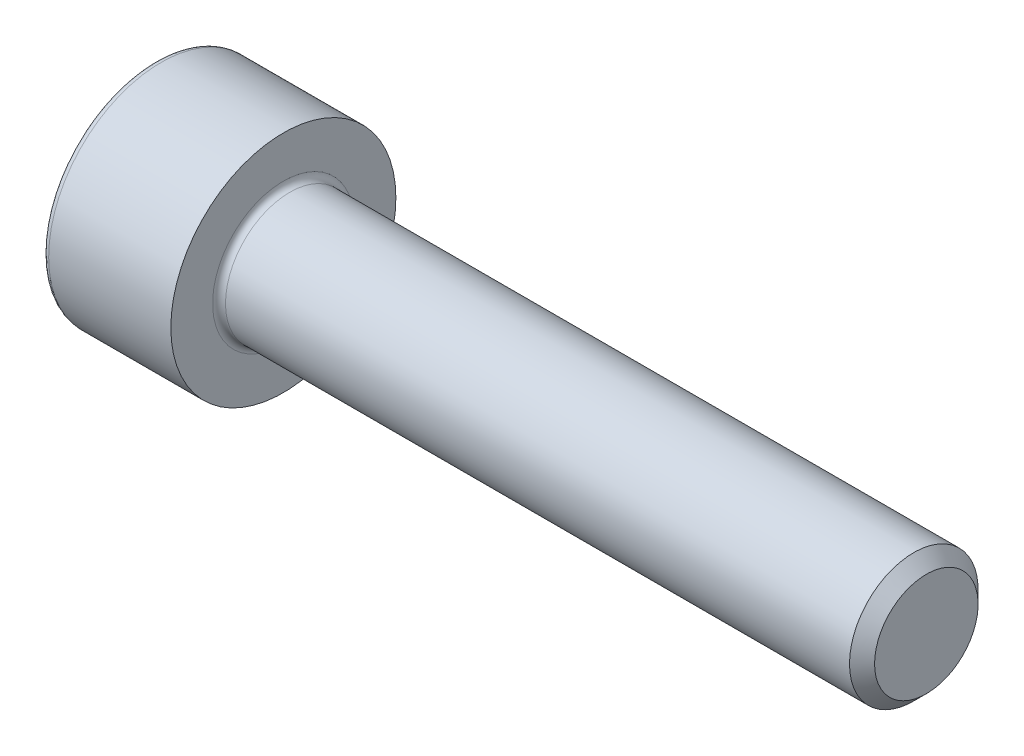
ISO-10303-21;
HEADER;
FILE_DESCRIPTION(('STEP AP214'),'2;1');
FILE_NAME('part.step','',(''),(''),'','','');
FILE_SCHEMA(('AUTOMOTIVE_DESIGN { 1 0 10303 214 1 1 1 1 }'));
ENDSEC;
DATA;
#1=APPLICATION_CONTEXT('core data for automotive mechanical design processes');
#2=APPLICATION_PROTOCOL_DEFINITION('international standard','automotive_design',2000,#1);
#3=PRODUCT_CONTEXT('',#1,'mechanical');
#4=PRODUCT('Part','Part','',(#3));
#5=PRODUCT_RELATED_PRODUCT_CATEGORY('part','',(#4));
#6=PRODUCT_DEFINITION_FORMATION('','',#4);
#7=PRODUCT_DEFINITION_CONTEXT('part definition',#1,'design');
#8=PRODUCT_DEFINITION('design','',#6,#7);
#9=PRODUCT_DEFINITION_SHAPE('','',#8);
#10=(LENGTH_UNIT() NAMED_UNIT(*) SI_UNIT(.MILLI.,.METRE.));
#11=(NAMED_UNIT(*) PLANE_ANGLE_UNIT() SI_UNIT($,.RADIAN.));
#12=(NAMED_UNIT(*) SI_UNIT($,.STERADIAN.) SOLID_ANGLE_UNIT());
#13=UNCERTAINTY_MEASURE_WITH_UNIT(LENGTH_MEASURE(1.E-05),#10,'distance_accuracy_value','');
#14=(GEOMETRIC_REPRESENTATION_CONTEXT(3) GLOBAL_UNCERTAINTY_ASSIGNED_CONTEXT((#13)) GLOBAL_UNIT_ASSIGNED_CONTEXT((#10,
#11,#12)) REPRESENTATION_CONTEXT('',''));
#15=CARTESIAN_POINT('',(0.,0.,0.));
#16=DIRECTION('',(0.,0.,1.));
#17=DIRECTION('',(1.,0.,0.));
#18=AXIS2_PLACEMENT_3D('',#15,#16,#17);
#19=CARTESIAN_POINT('',(0.,0.,0.));
#20=DIRECTION('',(-1.,0.,0.));
#21=DIRECTION('',(0.,0.,1.));
#22=AXIS2_PLACEMENT_3D('',#19,#20,#21);
#23=PLANE('',#22);
#24=DIRECTION('',(0.,-0.499999999999999,0.866025403784439));
#25=VECTOR('',#24,1.);
#26=CARTESIAN_POINT('',(0.,1.77304267668134,0.));
#27=LINE('',#26,#25);
#28=CARTESIAN_POINT('',(0.,1.77304267668134,0.));
#29=VERTEX_POINT('',#28);
#30=CARTESIAN_POINT('',(0.,0.886521338340669,1.5355));
#31=VERTEX_POINT('',#30);
#32=EDGE_CURVE('E374',#29,#31,#27,.T.);
#33=ORIENTED_EDGE('',*,*,#32,.T.);
#34=DIRECTION('',(0.,1.,0.));
#35=VECTOR('',#34,1.);
#36=CARTESIAN_POINT('',(0.,-0.886521338340672,1.5355));
#37=LINE('',#36,#35);
#38=CARTESIAN_POINT('',(0.,-0.886521338340672,1.5355));
#39=VERTEX_POINT('',#38);
#40=EDGE_CURVE('E131',#39,#31,#37,.T.);
#41=ORIENTED_EDGE('',*,*,#40,.F.);
#42=DIRECTION('',(0.,-0.500000000000001,-0.866025403784438));
#43=VECTOR('',#42,1.);
#44=CARTESIAN_POINT('',(0.,-0.886521338340672,1.5355));
#45=LINE('',#44,#43);
#46=CARTESIAN_POINT('',(0.,-1.77304267668134,0.));
#47=VERTEX_POINT('',#46);
#48=EDGE_CURVE('E377',#39,#47,#45,.T.);
#49=ORIENTED_EDGE('',*,*,#48,.T.);
#50=DIRECTION('',(0.,0.499999999999999,-0.866025403784439));
#51=VECTOR('',#50,1.);
#52=CARTESIAN_POINT('',(0.,-1.77304267668134,0.));
#53=LINE('',#52,#51);
#54=CARTESIAN_POINT('',(0.,-0.886521338340676,-1.5355));
#55=VERTEX_POINT('',#54);
#56=EDGE_CURVE('E380',#47,#55,#53,.T.);
#57=ORIENTED_EDGE('',*,*,#56,.T.);
#58=DIRECTION('',(0.,-1.,0.));
#59=VECTOR('',#58,1.);
#60=CARTESIAN_POINT('',(0.,0.886521338340665,-1.5355));
#61=LINE('',#60,#59);
#62=CARTESIAN_POINT('',(0.,0.886521338340665,-1.5355));
#63=VERTEX_POINT('',#62);
#64=EDGE_CURVE('E383',#63,#55,#61,.T.);
#65=ORIENTED_EDGE('',*,*,#64,.F.);
#66=DIRECTION('',(0.,-0.500000000000001,-0.866025403784438));
#67=VECTOR('',#66,1.);
#68=CARTESIAN_POINT('',(0.,1.77304267668134,0.));
#69=LINE('',#68,#67);
#70=EDGE_CURVE('E126',#29,#63,#69,.T.);
#71=ORIENTED_EDGE('',*,*,#70,.F.);
#72=EDGE_LOOP('',(#33,#41,#49,#57,#65,#71));
#73=FACE_BOUND('',#72,.T.);
#74=CARTESIAN_POINT('',(0.,0.,0.));
#75=DIRECTION('',(-1.,0.,0.));
#76=DIRECTION('',(0.,0.,1.));
#77=AXIS2_PLACEMENT_3D('',#74,#75,#76);
#78=CIRCLE('',#77,3.3);
#79=CARTESIAN_POINT('',(0.,0.,3.3));
#80=VERTEX_POINT('',#79);
#81=EDGE_CURVE('E43',#80,#80,#78,.T.);
#82=ORIENTED_EDGE('',*,*,#81,.T.);
#83=EDGE_LOOP('',(#82));
#84=FACE_BOUND('',#83,.T.);
#85=ADVANCED_FACE('F35',(#73,#84),#23,.T.);
#86=CARTESIAN_POINT('',(24.,1.61,0.));
#87=DIRECTION('',(1.,0.,0.));
#88=DIRECTION('',(0.,0.,-1.));
#89=AXIS2_PLACEMENT_3D('',#86,#87,#88);
#90=PLANE('',#89);
#91=CARTESIAN_POINT('',(24.,0.,0.));
#92=DIRECTION('',(-1.,0.,0.));
#93=DIRECTION('',(0.,0.,1.));
#94=AXIS2_PLACEMENT_3D('',#91,#92,#93);
#95=CIRCLE('',#94,1.61);
#96=CARTESIAN_POINT('',(24.,0.,1.61));
#97=VERTEX_POINT('',#96);
#98=EDGE_CURVE('E149',#97,#97,#95,.T.);
#99=ORIENTED_EDGE('',*,*,#98,.F.);
#100=EDGE_LOOP('',(#99));
#101=FACE_BOUND('',#100,.T.);
#102=ADVANCED_FACE('F173',(#101),#90,.T.);
#103=CARTESIAN_POINT('',(24.,0.,0.));
#104=DIRECTION('',(-1.,0.,0.));
#105=DIRECTION('',(0.,0.,1.));
#106=AXIS2_PLACEMENT_3D('',#103,#104,#105);
#107=CONICAL_SURFACE('',#106,1.61,0.785398163397393);
#108=CARTESIAN_POINT('',(23.61,0.,0.));
#109=DIRECTION('',(-1.,0.,0.));
#110=DIRECTION('',(0.,0.,1.));
#111=AXIS2_PLACEMENT_3D('',#108,#109,#110);
#112=CIRCLE('',#111,1.99999999999997);
#113=CARTESIAN_POINT('',(23.61,0.,1.99999999999997));
#114=VERTEX_POINT('',#113);
#115=EDGE_CURVE('E146',#114,#114,#112,.T.);
#116=ORIENTED_EDGE('',*,*,#115,.F.);
#117=EDGE_LOOP('',(#116));
#118=FACE_BOUND('',#117,.T.);
#119=ORIENTED_EDGE('',*,*,#98,.T.);
#120=EDGE_LOOP('',(#119));
#121=FACE_BOUND('',#120,.T.);
#122=ADVANCED_FACE('F179',(#118,#121),#107,.T.);
#123=CARTESIAN_POINT('',(-31.75,0.,0.));
#124=DIRECTION('',(-1.,0.,0.));
#125=DIRECTION('',(0.,0.,1.));
#126=AXIS2_PLACEMENT_3D('',#123,#124,#125);
#127=CYLINDRICAL_SURFACE('',#126,1.99999999999999);
#128=CARTESIAN_POINT('',(4.2,0.,0.));
#129=DIRECTION('',(1.,0.,0.));
#130=DIRECTION('',(0.,0.,-1.));
#131=AXIS2_PLACEMENT_3D('',#128,#129,#130);
#132=CIRCLE('',#131,1.99999999999999);
#133=CARTESIAN_POINT('',(4.2,0.,-1.99999999999999));
#134=VERTEX_POINT('',#133);
#135=EDGE_CURVE('E155',#134,#134,#132,.T.);
#136=ORIENTED_EDGE('',*,*,#135,.T.);
#137=EDGE_LOOP('',(#136));
#138=FACE_BOUND('',#137,.T.);
#139=ORIENTED_EDGE('',*,*,#115,.T.);
#140=EDGE_LOOP('',(#139));
#141=FACE_BOUND('',#140,.T.);
#142=ADVANCED_FACE('F191',(#138,#141),#127,.T.);
#143=CARTESIAN_POINT('',(4.,3.5,0.));
#144=DIRECTION('',(1.,0.,0.));
#145=DIRECTION('',(0.,0.,-1.));
#146=AXIS2_PLACEMENT_3D('',#143,#144,#145);
#147=PLANE('',#146);
#148=CARTESIAN_POINT('',(4.,0.,0.));
#149=DIRECTION('',(1.,0.,0.));
#150=DIRECTION('',(0.,0.,-1.));
#151=AXIS2_PLACEMENT_3D('',#148,#149,#150);
#152=CIRCLE('',#151,2.19999999999999);
#153=CARTESIAN_POINT('',(4.,0.,-2.19999999999999));
#154=VERTEX_POINT('',#153);
#155=EDGE_CURVE('E152',#154,#154,#152,.F.);
#156=ORIENTED_EDGE('',*,*,#155,.T.);
#157=EDGE_LOOP('',(#156));
#158=FACE_BOUND('',#157,.T.);
#159=CARTESIAN_POINT('',(4.,0.,0.));
#160=DIRECTION('',(-1.,0.,0.));
#161=DIRECTION('',(0.,0.,1.));
#162=AXIS2_PLACEMENT_3D('',#159,#160,#161);
#163=CIRCLE('',#162,3.5);
#164=CARTESIAN_POINT('',(4.,0.,3.5));
#165=VERTEX_POINT('',#164);
#166=EDGE_CURVE('E142',#165,#165,#163,.T.);
#167=ORIENTED_EDGE('',*,*,#166,.F.);
#168=EDGE_LOOP('',(#167));
#169=FACE_BOUND('',#168,.T.);
#170=ADVANCED_FACE('F187',(#158,#169),#147,.T.);
#171=CARTESIAN_POINT('',(-31.75,0.,0.));
#172=DIRECTION('',(-1.,0.,0.));
#173=DIRECTION('',(0.,0.,1.));
#174=AXIS2_PLACEMENT_3D('',#171,#172,#173);
#175=CYLINDRICAL_SURFACE('',#174,3.5);
#176=CARTESIAN_POINT('',(0.199999999999999,0.,0.));
#177=DIRECTION('',(-1.,0.,0.));
#178=DIRECTION('',(0.,0.,1.));
#179=AXIS2_PLACEMENT_3D('',#176,#177,#178);
#180=CIRCLE('',#179,3.5);
#181=CARTESIAN_POINT('',(0.199999999999999,0.,3.5));
#182=VERTEX_POINT('',#181);
#183=EDGE_CURVE('E11',#182,#182,#180,.F.);
#184=ORIENTED_EDGE('',*,*,#183,.T.);
#185=EDGE_LOOP('',(#184));
#186=FACE_BOUND('',#185,.T.);
#187=ORIENTED_EDGE('',*,*,#166,.T.);
#188=EDGE_LOOP('',(#187));
#189=FACE_BOUND('',#188,.T.);
#190=ADVANCED_FACE('F169',(#186,#189),#175,.T.);
#191=CARTESIAN_POINT('',(4.2,0.,0.));
#192=DIRECTION('',(1.,0.,0.));
#193=DIRECTION('',(0.,0.,-1.));
#194=AXIS2_PLACEMENT_3D('',#191,#192,#193);
#195=TOROIDAL_SURFACE('',#194,2.19999999999999,0.2);
#196=ORIENTED_EDGE('',*,*,#135,.F.);
#197=EDGE_LOOP('',(#196));
#198=FACE_BOUND('',#197,.T.);
#199=ORIENTED_EDGE('',*,*,#155,.F.);
#200=EDGE_LOOP('',(#199));
#201=FACE_BOUND('',#200,.T.);
#202=ADVANCED_FACE('F162',(#198,#201),#195,.F.);
#203=CARTESIAN_POINT('',(0.199999999999999,0.,0.));
#204=DIRECTION('',(-1.,0.,0.));
#205=DIRECTION('',(0.,0.,1.));
#206=AXIS2_PLACEMENT_3D('',#203,#204,#205);
#207=TOROIDAL_SURFACE('',#206,3.3,0.2);
#208=ORIENTED_EDGE('',*,*,#183,.F.);
#209=EDGE_LOOP('',(#208));
#210=FACE_BOUND('',#209,.T.);
#211=ORIENTED_EDGE('',*,*,#81,.F.);
#212=EDGE_LOOP('',(#211));
#213=FACE_BOUND('',#212,.T.);
#214=ADVANCED_FACE('F37',(#210,#213),#207,.T.);
#215=CARTESIAN_POINT('',(2.,1.77304267668134,0.));
#216=DIRECTION('',(0.,-0.866025403784439,-0.499999999999999));
#217=DIRECTION('',(0.,0.499999999999999,-0.866025403784439));
#218=AXIS2_PLACEMENT_3D('',#215,#216,#217);
#219=PLANE('',#218);
#220=ORIENTED_EDGE('',*,*,#32,.F.);
#221=DIRECTION('',(-1.,0.,0.));
#222=VECTOR('',#221,1.);
#223=CARTESIAN_POINT('',(2.,1.77304267668134,0.));
#224=LINE('',#223,#222);
#225=CARTESIAN_POINT('',(2.,1.77304267668134,0.));
#226=VERTEX_POINT('',#225);
#227=EDGE_CURVE('E364',#226,#29,#224,.T.);
#228=ORIENTED_EDGE('',*,*,#227,.F.);
#229=DIRECTION('',(0.,-0.499999999999999,0.866025403784439));
#230=VECTOR('',#229,1.);
#231=CARTESIAN_POINT('',(2.,1.77304267668134,0.));
#232=LINE('',#231,#230);
#233=CARTESIAN_POINT('',(2.,1.329782007511,0.767749999999997));
#234=VERTEX_POINT('',#233);
#235=EDGE_CURVE('E118',#226,#234,#232,.T.);
#236=ORIENTED_EDGE('',*,*,#235,.T.);
#237=CARTESIAN_POINT('',(2.,0.886521338340669,1.5355));
#238=VERTEX_POINT('',#237);
#239=EDGE_CURVE('E109',#234,#238,#232,.T.);
#240=ORIENTED_EDGE('',*,*,#239,.T.);
#241=DIRECTION('',(-1.,0.,0.));
#242=VECTOR('',#241,1.);
#243=CARTESIAN_POINT('',(2.,0.886521338340669,1.5355));
#244=LINE('',#243,#242);
#245=EDGE_CURVE('E123',#238,#31,#244,.T.);
#246=ORIENTED_EDGE('',*,*,#245,.T.);
#247=EDGE_LOOP('',(#220,#228,#236,#240,#246));
#248=FACE_BOUND('',#247,.T.);
#249=ADVANCED_FACE('F122',(#248),#219,.T.);
#250=CARTESIAN_POINT('',(2.,-0.886521338340672,1.5355));
#251=DIRECTION('',(0.,0.,1.));
#252=DIRECTION('',(0.,-1.,0.));
#253=AXIS2_PLACEMENT_3D('',#250,#251,#252);
#254=PLANE('',#253);
#255=ORIENTED_EDGE('',*,*,#40,.T.);
#256=ORIENTED_EDGE('',*,*,#245,.F.);
#257=DIRECTION('',(0.,1.,0.));
#258=VECTOR('',#257,1.);
#259=CARTESIAN_POINT('',(2.,-0.886521338340672,1.5355));
#260=LINE('',#259,#258);
#261=CARTESIAN_POINT('',(2.,0.,1.5355));
#262=VERTEX_POINT('',#261);
#263=EDGE_CURVE('E106',#262,#238,#260,.T.);
#264=ORIENTED_EDGE('',*,*,#263,.F.);
#265=CARTESIAN_POINT('',(2.,-0.886521338340672,1.5355));
#266=VERTEX_POINT('',#265);
#267=EDGE_CURVE('E117',#266,#262,#260,.T.);
#268=ORIENTED_EDGE('',*,*,#267,.F.);
#269=DIRECTION('',(-1.,0.,0.));
#270=VECTOR('',#269,1.);
#271=CARTESIAN_POINT('',(2.,-0.886521338340672,1.5355));
#272=LINE('',#271,#270);
#273=EDGE_CURVE('E133',#266,#39,#272,.T.);
#274=ORIENTED_EDGE('',*,*,#273,.T.);
#275=EDGE_LOOP('',(#255,#256,#264,#268,#274));
#276=FACE_BOUND('',#275,.T.);
#277=ADVANCED_FACE('F128',(#276),#254,.F.);
#278=CARTESIAN_POINT('',(2.,-0.886521338340672,1.5355));
#279=DIRECTION('',(0.,0.866025403784438,-0.500000000000001));
#280=DIRECTION('',(0.,0.500000000000001,0.866025403784438));
#281=AXIS2_PLACEMENT_3D('',#278,#279,#280);
#282=PLANE('',#281);
#283=ORIENTED_EDGE('',*,*,#48,.F.);
#284=ORIENTED_EDGE('',*,*,#273,.F.);
#285=DIRECTION('',(0.,-0.500000000000001,-0.866025403784438));
#286=VECTOR('',#285,1.);
#287=CARTESIAN_POINT('',(2.,-0.886521338340672,1.5355));
#288=LINE('',#287,#286);
#289=CARTESIAN_POINT('',(2.,-1.32978200751101,0.767750000000003));
#290=VERTEX_POINT('',#289);
#291=EDGE_CURVE('E403',#266,#290,#288,.T.);
#292=ORIENTED_EDGE('',*,*,#291,.T.);
#293=CARTESIAN_POINT('',(2.,-1.77304267668134,0.));
#294=VERTEX_POINT('',#293);
#295=EDGE_CURVE('E392',#290,#294,#288,.T.);
#296=ORIENTED_EDGE('',*,*,#295,.T.);
#297=DIRECTION('',(-1.,0.,0.));
#298=VECTOR('',#297,1.);
#299=CARTESIAN_POINT('',(2.,-1.77304267668134,0.));
#300=LINE('',#299,#298);
#301=EDGE_CURVE('E138',#294,#47,#300,.T.);
#302=ORIENTED_EDGE('',*,*,#301,.T.);
#303=EDGE_LOOP('',(#283,#284,#292,#296,#302));
#304=FACE_BOUND('',#303,.T.);
#305=ADVANCED_FACE('F255',(#304),#282,.T.);
#306=CARTESIAN_POINT('',(2.,-1.77304267668134,0.));
#307=DIRECTION('',(0.,0.866025403784439,0.499999999999999));
#308=DIRECTION('',(0.,-0.499999999999999,0.866025403784439));
#309=AXIS2_PLACEMENT_3D('',#306,#307,#308);
#310=PLANE('',#309);
#311=ORIENTED_EDGE('',*,*,#56,.F.);
#312=ORIENTED_EDGE('',*,*,#301,.F.);
#313=DIRECTION('',(0.,0.499999999999999,-0.866025403784439));
#314=VECTOR('',#313,1.);
#315=CARTESIAN_POINT('',(2.,-1.77304267668134,0.));
#316=LINE('',#315,#314);
#317=CARTESIAN_POINT('',(2.,-1.32978200751101,-0.767750000000001));
#318=VERTEX_POINT('',#317);
#319=EDGE_CURVE('E370',#294,#318,#316,.T.);
#320=ORIENTED_EDGE('',*,*,#319,.T.);
#321=CARTESIAN_POINT('',(2.,-0.886521338340676,-1.5355));
#322=VERTEX_POINT('',#321);
#323=EDGE_CURVE('E402',#318,#322,#316,.T.);
#324=ORIENTED_EDGE('',*,*,#323,.T.);
#325=DIRECTION('',(-1.,0.,0.));
#326=VECTOR('',#325,1.);
#327=CARTESIAN_POINT('',(2.,-0.886521338340676,-1.5355));
#328=LINE('',#327,#326);
#329=EDGE_CURVE('E363',#322,#55,#328,.T.);
#330=ORIENTED_EDGE('',*,*,#329,.T.);
#331=EDGE_LOOP('',(#311,#312,#320,#324,#330));
#332=FACE_BOUND('',#331,.T.);
#333=ADVANCED_FACE('F263',(#332),#310,.T.);
#334=CARTESIAN_POINT('',(2.,0.886521338340665,-1.5355));
#335=DIRECTION('',(0.,0.,-1.));
#336=DIRECTION('',(0.,1.,0.));
#337=AXIS2_PLACEMENT_3D('',#334,#335,#336);
#338=PLANE('',#337);
#339=ORIENTED_EDGE('',*,*,#64,.T.);
#340=ORIENTED_EDGE('',*,*,#329,.F.);
#341=DIRECTION('',(0.,-1.,0.));
#342=VECTOR('',#341,1.);
#343=CARTESIAN_POINT('',(2.,0.886521338340665,-1.5355));
#344=LINE('',#343,#342);
#345=CARTESIAN_POINT('',(2.,0.,-1.5355));
#346=VERTEX_POINT('',#345);
#347=EDGE_CURVE('E367',#346,#322,#344,.T.);
#348=ORIENTED_EDGE('',*,*,#347,.F.);
#349=CARTESIAN_POINT('',(2.,0.886521338340665,-1.5355));
#350=VERTEX_POINT('',#349);
#351=EDGE_CURVE('E50',#350,#346,#344,.T.);
#352=ORIENTED_EDGE('',*,*,#351,.F.);
#353=DIRECTION('',(-1.,0.,0.));
#354=VECTOR('',#353,1.);
#355=CARTESIAN_POINT('',(2.,0.886521338340665,-1.5355));
#356=LINE('',#355,#354);
#357=EDGE_CURVE('E360',#350,#63,#356,.T.);
#358=ORIENTED_EDGE('',*,*,#357,.T.);
#359=EDGE_LOOP('',(#339,#340,#348,#352,#358));
#360=FACE_BOUND('',#359,.T.);
#361=ADVANCED_FACE('F272',(#360),#338,.F.);
#362=CARTESIAN_POINT('',(2.,1.77304267668134,0.));
#363=DIRECTION('',(0.,0.866025403784438,-0.500000000000001));
#364=DIRECTION('',(0.,0.500000000000001,0.866025403784438));
#365=AXIS2_PLACEMENT_3D('',#362,#363,#364);
#366=PLANE('',#365);
#367=ORIENTED_EDGE('',*,*,#70,.T.);
#368=ORIENTED_EDGE('',*,*,#357,.F.);
#369=DIRECTION('',(0.,-0.500000000000001,-0.866025403784438));
#370=VECTOR('',#369,1.);
#371=CARTESIAN_POINT('',(2.,1.77304267668134,0.));
#372=LINE('',#371,#370);
#373=CARTESIAN_POINT('',(2.,1.329782007511,-0.767750000000001));
#374=VERTEX_POINT('',#373);
#375=EDGE_CURVE('E350',#374,#350,#372,.T.);
#376=ORIENTED_EDGE('',*,*,#375,.F.);
#377=EDGE_CURVE('E356',#226,#374,#372,.T.);
#378=ORIENTED_EDGE('',*,*,#377,.F.);
#379=ORIENTED_EDGE('',*,*,#227,.T.);
#380=EDGE_LOOP('',(#367,#368,#376,#378,#379));
#381=FACE_BOUND('',#380,.T.);
#382=ADVANCED_FACE('F281',(#381),#366,.F.);
#383=CARTESIAN_POINT('',(2.,1.77304267668134,0.));
#384=DIRECTION('',(1.,0.,0.));
#385=DIRECTION('',(0.,0.,-1.));
#386=AXIS2_PLACEMENT_3D('',#383,#384,#385);
#387=PLANE('',#386);
#388=ORIENTED_EDGE('',*,*,#347,.T.);
#389=ORIENTED_EDGE('',*,*,#323,.F.);
#390=CARTESIAN_POINT('',(2.,0.,0.));
#391=DIRECTION('',(-1.,0.,0.));
#392=DIRECTION('',(0.,0.,1.));
#393=AXIS2_PLACEMENT_3D('',#390,#391,#392);
#394=CIRCLE('',#393,1.5355);
#395=EDGE_CURVE('E398',#346,#318,#394,.T.);
#396=ORIENTED_EDGE('',*,*,#395,.F.);
#397=EDGE_LOOP('',(#388,#389,#396));
#398=FACE_BOUND('',#397,.T.);
#399=ADVANCED_FACE('F290',(#398),#387,.F.);
#400=ORIENTED_EDGE('',*,*,#319,.F.);
#401=ORIENTED_EDGE('',*,*,#295,.F.);
#402=EDGE_CURVE('E136',#318,#290,#394,.T.);
#403=ORIENTED_EDGE('',*,*,#402,.F.);
#404=EDGE_LOOP('',(#400,#401,#403));
#405=FACE_BOUND('',#404,.T.);
#406=ADVANCED_FACE('F299',(#405),#387,.F.);
#407=ORIENTED_EDGE('',*,*,#291,.F.);
#408=ORIENTED_EDGE('',*,*,#267,.T.);
#409=EDGE_CURVE('E132',#290,#262,#394,.T.);
#410=ORIENTED_EDGE('',*,*,#409,.F.);
#411=EDGE_LOOP('',(#407,#408,#410));
#412=FACE_BOUND('',#411,.T.);
#413=ADVANCED_FACE('F308',(#412),#387,.F.);
#414=ORIENTED_EDGE('',*,*,#263,.T.);
#415=ORIENTED_EDGE('',*,*,#239,.F.);
#416=EDGE_CURVE('E112',#262,#234,#394,.T.);
#417=ORIENTED_EDGE('',*,*,#416,.F.);
#418=EDGE_LOOP('',(#414,#415,#417));
#419=FACE_BOUND('',#418,.T.);
#420=ADVANCED_FACE('F108',(#419),#387,.F.);
#421=ORIENTED_EDGE('',*,*,#235,.F.);
#422=ORIENTED_EDGE('',*,*,#377,.T.);
#423=EDGE_CURVE('E143',#234,#374,#394,.T.);
#424=ORIENTED_EDGE('',*,*,#423,.F.);
#425=EDGE_LOOP('',(#421,#422,#424));
#426=FACE_BOUND('',#425,.T.);
#427=ADVANCED_FACE('F323',(#426),#387,.F.);
#428=ORIENTED_EDGE('',*,*,#375,.T.);
#429=ORIENTED_EDGE('',*,*,#351,.T.);
#430=EDGE_CURVE('E353',#374,#346,#394,.T.);
#431=ORIENTED_EDGE('',*,*,#430,.F.);
#432=EDGE_LOOP('',(#428,#429,#431));
#433=FACE_BOUND('',#432,.T.);
#434=ADVANCED_FACE('F238',(#433),#387,.F.);
#435=CARTESIAN_POINT('',(2.,0.,0.));
#436=DIRECTION('',(-1.,0.,0.));
#437=DIRECTION('',(0.,0.,1.));
#438=AXIS2_PLACEMENT_3D('',#435,#436,#437);
#439=CONICAL_SURFACE('',#438,1.5355,1.04719755119659);
#440=CARTESIAN_POINT('',(2.88652133834068,0.,0.));
#441=VERTEX_POINT('',#440);
#442=VERTEX_LOOP('',#441);
#443=FACE_BOUND('',#442,.T.);
#444=ORIENTED_EDGE('',*,*,#416,.T.);
#445=ORIENTED_EDGE('',*,*,#423,.T.);
#446=ORIENTED_EDGE('',*,*,#430,.T.);
#447=ORIENTED_EDGE('',*,*,#395,.T.);
#448=ORIENTED_EDGE('',*,*,#402,.T.);
#449=ORIENTED_EDGE('',*,*,#409,.T.);
#450=EDGE_LOOP('',(#444,#445,#446,#447,#448,#449));
#451=FACE_BOUND('',#450,.T.);
#452=ADVANCED_FACE('F184',(#443,#451),#439,.F.);
#453=CLOSED_SHELL('',(#85,#102,#122,#142,#170,#190,#202,#214,#249,#277,#305,#333,#361,#382,#399,
#406,#413,#420,#427,#434,#452));
#454=MANIFOLD_SOLID_BREP('B2',#453);
#455=ADVANCED_BREP_SHAPE_REPRESENTATION('',(#18,#454),#14);
#456=SHAPE_DEFINITION_REPRESENTATION(#9,#455);
ENDSEC;
END-ISO-10303-21;
